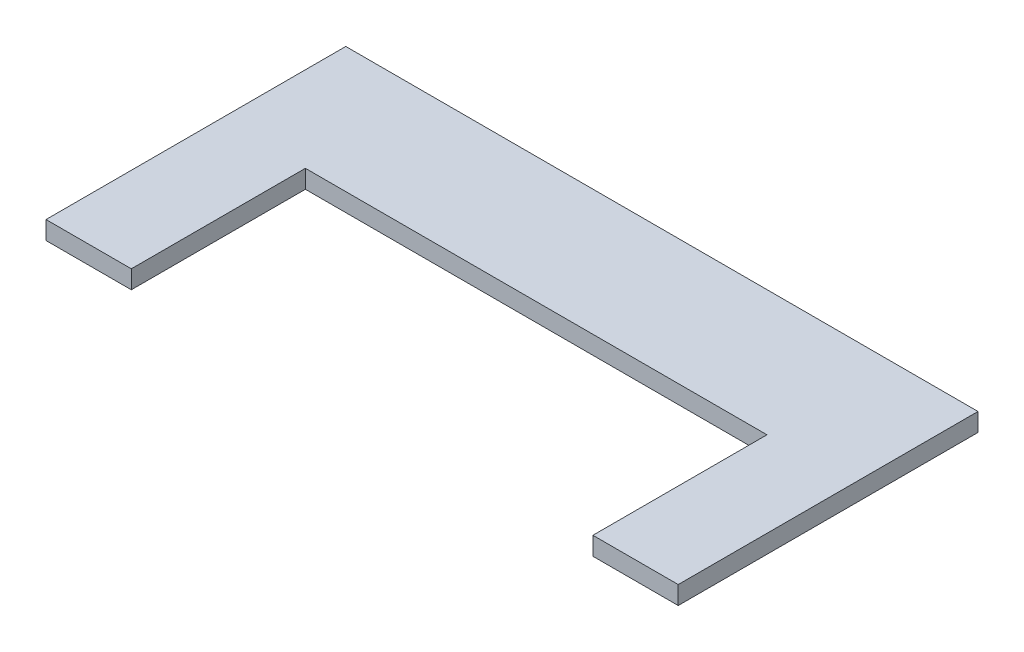
ISO-10303-21;
HEADER;
FILE_DESCRIPTION(('STEP AP214'),'2;1');
FILE_NAME('part.step','',(''),(''),'','','');
FILE_SCHEMA(('AUTOMOTIVE_DESIGN { 1 0 10303 214 1 1 1 1 }'));
ENDSEC;
DATA;
#1=APPLICATION_CONTEXT('core data for automotive mechanical design processes');
#2=APPLICATION_PROTOCOL_DEFINITION('international standard','automotive_design',2000,#1);
#3=PRODUCT_CONTEXT('',#1,'mechanical');
#4=PRODUCT('Part','Part','',(#3));
#5=PRODUCT_RELATED_PRODUCT_CATEGORY('part','',(#4));
#6=PRODUCT_DEFINITION_FORMATION('','',#4);
#7=PRODUCT_DEFINITION_CONTEXT('part definition',#1,'design');
#8=PRODUCT_DEFINITION('design','',#6,#7);
#9=PRODUCT_DEFINITION_SHAPE('','',#8);
#10=(LENGTH_UNIT() NAMED_UNIT(*) SI_UNIT(.MILLI.,.METRE.));
#11=(NAMED_UNIT(*) PLANE_ANGLE_UNIT() SI_UNIT($,.RADIAN.));
#12=(NAMED_UNIT(*) SI_UNIT($,.STERADIAN.) SOLID_ANGLE_UNIT());
#13=UNCERTAINTY_MEASURE_WITH_UNIT(LENGTH_MEASURE(1.E-05),#10,'distance_accuracy_value','');
#14=(GEOMETRIC_REPRESENTATION_CONTEXT(3) GLOBAL_UNCERTAINTY_ASSIGNED_CONTEXT((#13)) GLOBAL_UNIT_ASSIGNED_CONTEXT((#10,
#11,#12)) REPRESENTATION_CONTEXT('',''));
#15=CARTESIAN_POINT('',(0.,0.,0.));
#16=DIRECTION('',(0.,0.,1.));
#17=DIRECTION('',(1.,0.,0.));
#18=AXIS2_PLACEMENT_3D('',#15,#16,#17);
#19=CARTESIAN_POINT('',(-55.5722171016874,3.2,-52.7));
#20=DIRECTION('',(1.,0.,0.));
#21=DIRECTION('',(0.,0.,-1.));
#22=AXIS2_PLACEMENT_3D('',#19,#20,#21);
#23=PLANE('',#22);
#24=DIRECTION('',(0.,0.,1.));
#25=VECTOR('',#24,1.);
#26=CARTESIAN_POINT('',(-55.5722171016874,0.,-52.7));
#27=LINE('',#26,#25);
#28=CARTESIAN_POINT('',(-55.5722171016874,0.,-52.7));
#29=VERTEX_POINT('',#28);
#30=CARTESIAN_POINT('',(-55.5722171016874,0.,0.));
#31=VERTEX_POINT('',#30);
#32=EDGE_CURVE('E129',#29,#31,#27,.T.);
#33=ORIENTED_EDGE('',*,*,#32,.T.);
#34=DIRECTION('',(0.,-1.,0.));
#35=VECTOR('',#34,1.);
#36=CARTESIAN_POINT('',(-55.5722171016874,3.2,0.));
#37=LINE('',#36,#35);
#38=CARTESIAN_POINT('',(-55.5722171016874,3.2,0.));
#39=VERTEX_POINT('',#38);
#40=EDGE_CURVE('E11',#39,#31,#37,.T.);
#41=ORIENTED_EDGE('',*,*,#40,.F.);
#42=DIRECTION('',(0.,0.,1.));
#43=VECTOR('',#42,1.);
#44=CARTESIAN_POINT('',(-55.5722171016874,3.2,-52.7));
#45=LINE('',#44,#43);
#46=CARTESIAN_POINT('',(-55.5722171016874,3.2,-52.7));
#47=VERTEX_POINT('',#46);
#48=EDGE_CURVE('E143',#47,#39,#45,.T.);
#49=ORIENTED_EDGE('',*,*,#48,.F.);
#50=DIRECTION('',(0.,-1.,0.));
#51=VECTOR('',#50,1.);
#52=CARTESIAN_POINT('',(-55.5722171016874,3.2,-52.7));
#53=LINE('',#52,#51);
#54=EDGE_CURVE('E125',#47,#29,#53,.T.);
#55=ORIENTED_EDGE('',*,*,#54,.T.);
#56=EDGE_LOOP('',(#33,#41,#49,#55));
#57=FACE_BOUND('',#56,.T.);
#58=ADVANCED_FACE('F33',(#57),#23,.F.);
#59=CARTESIAN_POINT('',(-40.5722171016874,3.2,0.));
#60=DIRECTION('',(0.,0.,-1.));
#61=DIRECTION('',(-1.,0.,0.));
#62=AXIS2_PLACEMENT_3D('',#59,#60,#61);
#63=PLANE('',#62);
#64=DIRECTION('',(1.,0.,0.));
#65=VECTOR('',#64,1.);
#66=CARTESIAN_POINT('',(-40.5722171016874,0.,0.));
#67=LINE('',#66,#65);
#68=CARTESIAN_POINT('',(-40.5722171016874,0.,0.));
#69=VERTEX_POINT('',#68);
#70=EDGE_CURVE('E132',#31,#69,#67,.T.);
#71=ORIENTED_EDGE('',*,*,#70,.T.);
#72=DIRECTION('',(0.,-1.,0.));
#73=VECTOR('',#72,1.);
#74=CARTESIAN_POINT('',(-40.5722171016874,3.2,0.));
#75=LINE('',#74,#73);
#76=CARTESIAN_POINT('',(-40.5722171016874,3.2,0.));
#77=VERTEX_POINT('',#76);
#78=EDGE_CURVE('E41',#77,#69,#75,.T.);
#79=ORIENTED_EDGE('',*,*,#78,.F.);
#80=DIRECTION('',(1.,0.,0.));
#81=VECTOR('',#80,1.);
#82=CARTESIAN_POINT('',(-40.5722171016874,3.2,0.));
#83=LINE('',#82,#81);
#84=EDGE_CURVE('E92',#39,#77,#83,.T.);
#85=ORIENTED_EDGE('',*,*,#84,.F.);
#86=ORIENTED_EDGE('',*,*,#40,.T.);
#87=EDGE_LOOP('',(#71,#79,#85,#86));
#88=FACE_BOUND('',#87,.T.);
#89=ADVANCED_FACE('F178',(#88),#63,.F.);
#90=CARTESIAN_POINT('',(-40.5722171016874,3.2,-30.6));
#91=DIRECTION('',(-1.,0.,0.));
#92=DIRECTION('',(0.,0.,1.));
#93=AXIS2_PLACEMENT_3D('',#90,#91,#92);
#94=PLANE('',#93);
#95=DIRECTION('',(0.,0.,-1.));
#96=VECTOR('',#95,1.);
#97=CARTESIAN_POINT('',(-40.5722171016874,0.,-30.6));
#98=LINE('',#97,#96);
#99=CARTESIAN_POINT('',(-40.5722171016874,0.,-30.6));
#100=VERTEX_POINT('',#99);
#101=EDGE_CURVE('E134',#69,#100,#98,.T.);
#102=ORIENTED_EDGE('',*,*,#101,.T.);
#103=DIRECTION('',(0.,-1.,0.));
#104=VECTOR('',#103,1.);
#105=CARTESIAN_POINT('',(-40.5722171016874,3.2,-30.6));
#106=LINE('',#105,#104);
#107=CARTESIAN_POINT('',(-40.5722171016874,3.2,-30.6));
#108=VERTEX_POINT('',#107);
#109=EDGE_CURVE('E150',#108,#100,#106,.T.);
#110=ORIENTED_EDGE('',*,*,#109,.F.);
#111=DIRECTION('',(0.,0.,-1.));
#112=VECTOR('',#111,1.);
#113=CARTESIAN_POINT('',(-40.5722171016874,3.2,-30.6));
#114=LINE('',#113,#112);
#115=EDGE_CURVE('E158',#77,#108,#114,.T.);
#116=ORIENTED_EDGE('',*,*,#115,.F.);
#117=ORIENTED_EDGE('',*,*,#78,.T.);
#118=EDGE_LOOP('',(#102,#110,#116,#117));
#119=FACE_BOUND('',#118,.T.);
#120=ADVANCED_FACE('F156',(#119),#94,.F.);
#121=CARTESIAN_POINT('',(40.5722171016874,3.2,-30.6));
#122=DIRECTION('',(0.,0.,-1.));
#123=DIRECTION('',(-1.,0.,0.));
#124=AXIS2_PLACEMENT_3D('',#121,#122,#123);
#125=PLANE('',#124);
#126=DIRECTION('',(1.,0.,0.));
#127=VECTOR('',#126,1.);
#128=CARTESIAN_POINT('',(40.5722171016874,0.,-30.6));
#129=LINE('',#128,#127);
#130=CARTESIAN_POINT('',(40.5722171016874,0.,-30.6));
#131=VERTEX_POINT('',#130);
#132=EDGE_CURVE('E136',#100,#131,#129,.T.);
#133=ORIENTED_EDGE('',*,*,#132,.T.);
#134=DIRECTION('',(0.,-1.,0.));
#135=VECTOR('',#134,1.);
#136=CARTESIAN_POINT('',(40.5722171016874,3.2,-30.6));
#137=LINE('',#136,#135);
#138=CARTESIAN_POINT('',(40.5722171016874,3.2,-30.6));
#139=VERTEX_POINT('',#138);
#140=EDGE_CURVE('E147',#139,#131,#137,.T.);
#141=ORIENTED_EDGE('',*,*,#140,.F.);
#142=DIRECTION('',(1.,0.,0.));
#143=VECTOR('',#142,1.);
#144=CARTESIAN_POINT('',(40.5722171016874,3.2,-30.6));
#145=LINE('',#144,#143);
#146=EDGE_CURVE('E170',#108,#139,#145,.T.);
#147=ORIENTED_EDGE('',*,*,#146,.F.);
#148=ORIENTED_EDGE('',*,*,#109,.T.);
#149=EDGE_LOOP('',(#133,#141,#147,#148));
#150=FACE_BOUND('',#149,.T.);
#151=ADVANCED_FACE('F166',(#150),#125,.F.);
#152=CARTESIAN_POINT('',(40.5722171016874,3.2,0.));
#153=DIRECTION('',(1.,0.,0.));
#154=DIRECTION('',(0.,0.,-1.));
#155=AXIS2_PLACEMENT_3D('',#152,#153,#154);
#156=PLANE('',#155);
#157=DIRECTION('',(0.,0.,1.));
#158=VECTOR('',#157,1.);
#159=CARTESIAN_POINT('',(40.5722171016874,0.,0.));
#160=LINE('',#159,#158);
#161=CARTESIAN_POINT('',(40.5722171016874,0.,0.));
#162=VERTEX_POINT('',#161);
#163=EDGE_CURVE('E138',#131,#162,#160,.T.);
#164=ORIENTED_EDGE('',*,*,#163,.T.);
#165=DIRECTION('',(0.,-1.,0.));
#166=VECTOR('',#165,1.);
#167=CARTESIAN_POINT('',(40.5722171016874,3.2,0.));
#168=LINE('',#167,#166);
#169=CARTESIAN_POINT('',(40.5722171016874,3.2,0.));
#170=VERTEX_POINT('',#169);
#171=EDGE_CURVE('E120',#170,#162,#168,.T.);
#172=ORIENTED_EDGE('',*,*,#171,.F.);
#173=DIRECTION('',(0.,0.,1.));
#174=VECTOR('',#173,1.);
#175=CARTESIAN_POINT('',(40.5722171016874,3.2,0.));
#176=LINE('',#175,#174);
#177=EDGE_CURVE('E111',#139,#170,#176,.T.);
#178=ORIENTED_EDGE('',*,*,#177,.F.);
#179=ORIENTED_EDGE('',*,*,#140,.T.);
#180=EDGE_LOOP('',(#164,#172,#178,#179));
#181=FACE_BOUND('',#180,.T.);
#182=ADVANCED_FACE('F169',(#181),#156,.F.);
#183=CARTESIAN_POINT('',(55.5722171016874,3.2,0.));
#184=DIRECTION('',(0.,0.,-1.));
#185=DIRECTION('',(-1.,0.,0.));
#186=AXIS2_PLACEMENT_3D('',#183,#184,#185);
#187=PLANE('',#186);
#188=DIRECTION('',(1.,0.,0.));
#189=VECTOR('',#188,1.);
#190=CARTESIAN_POINT('',(55.5722171016874,0.,0.));
#191=LINE('',#190,#189);
#192=CARTESIAN_POINT('',(55.5722171016874,0.,0.));
#193=VERTEX_POINT('',#192);
#194=EDGE_CURVE('E119',#162,#193,#191,.T.);
#195=ORIENTED_EDGE('',*,*,#194,.T.);
#196=DIRECTION('',(0.,-1.,0.));
#197=VECTOR('',#196,1.);
#198=CARTESIAN_POINT('',(55.5722171016874,3.2,0.));
#199=LINE('',#198,#197);
#200=CARTESIAN_POINT('',(55.5722171016874,3.2,0.));
#201=VERTEX_POINT('',#200);
#202=EDGE_CURVE('E116',#201,#193,#199,.T.);
#203=ORIENTED_EDGE('',*,*,#202,.F.);
#204=DIRECTION('',(1.,0.,0.));
#205=VECTOR('',#204,1.);
#206=CARTESIAN_POINT('',(55.5722171016874,3.2,0.));
#207=LINE('',#206,#205);
#208=EDGE_CURVE('E105',#170,#201,#207,.T.);
#209=ORIENTED_EDGE('',*,*,#208,.F.);
#210=ORIENTED_EDGE('',*,*,#171,.T.);
#211=EDGE_LOOP('',(#195,#203,#209,#210));
#212=FACE_BOUND('',#211,.T.);
#213=ADVANCED_FACE('F117',(#212),#187,.F.);
#214=CARTESIAN_POINT('',(55.5722171016874,3.2,-52.7));
#215=DIRECTION('',(-1.,0.,0.));
#216=DIRECTION('',(0.,0.,1.));
#217=AXIS2_PLACEMENT_3D('',#214,#215,#216);
#218=PLANE('',#217);
#219=DIRECTION('',(0.,0.,-1.));
#220=VECTOR('',#219,1.);
#221=CARTESIAN_POINT('',(55.5722171016874,0.,-52.7));
#222=LINE('',#221,#220);
#223=CARTESIAN_POINT('',(55.5722171016874,0.,-52.7));
#224=VERTEX_POINT('',#223);
#225=EDGE_CURVE('E78',#193,#224,#222,.T.);
#226=ORIENTED_EDGE('',*,*,#225,.T.);
#227=DIRECTION('',(0.,-1.,0.));
#228=VECTOR('',#227,1.);
#229=CARTESIAN_POINT('',(55.5722171016874,3.2,-52.7));
#230=LINE('',#229,#228);
#231=CARTESIAN_POINT('',(55.5722171016874,3.2,-52.7));
#232=VERTEX_POINT('',#231);
#233=EDGE_CURVE('E121',#232,#224,#230,.T.);
#234=ORIENTED_EDGE('',*,*,#233,.F.);
#235=DIRECTION('',(0.,0.,-1.));
#236=VECTOR('',#235,1.);
#237=CARTESIAN_POINT('',(55.5722171016874,3.2,-52.7));
#238=LINE('',#237,#236);
#239=EDGE_CURVE('E109',#201,#232,#238,.T.);
#240=ORIENTED_EDGE('',*,*,#239,.F.);
#241=ORIENTED_EDGE('',*,*,#202,.T.);
#242=EDGE_LOOP('',(#226,#234,#240,#241));
#243=FACE_BOUND('',#242,.T.);
#244=ADVANCED_FACE('F123',(#243),#218,.F.);
#245=CARTESIAN_POINT('',(-55.5722171016874,3.2,-52.7));
#246=DIRECTION('',(0.,0.,1.));
#247=DIRECTION('',(1.,0.,0.));
#248=AXIS2_PLACEMENT_3D('',#245,#246,#247);
#249=PLANE('',#248);
#250=DIRECTION('',(-1.,0.,0.));
#251=VECTOR('',#250,1.);
#252=CARTESIAN_POINT('',(-55.5722171016874,0.,-52.7));
#253=LINE('',#252,#251);
#254=EDGE_CURVE('E84',#224,#29,#253,.T.);
#255=ORIENTED_EDGE('',*,*,#254,.T.);
#256=ORIENTED_EDGE('',*,*,#54,.F.);
#257=DIRECTION('',(-1.,0.,0.));
#258=VECTOR('',#257,1.);
#259=CARTESIAN_POINT('',(-55.5722171016874,3.2,-52.7));
#260=LINE('',#259,#258);
#261=EDGE_CURVE('E49',#232,#47,#260,.T.);
#262=ORIENTED_EDGE('',*,*,#261,.F.);
#263=ORIENTED_EDGE('',*,*,#233,.T.);
#264=EDGE_LOOP('',(#255,#256,#262,#263));
#265=FACE_BOUND('',#264,.T.);
#266=ADVANCED_FACE('F194',(#265),#249,.F.);
#267=CARTESIAN_POINT('',(0.,3.2,0.));
#268=DIRECTION('',(0.,-1.,0.));
#269=DIRECTION('',(0.,0.,-1.));
#270=AXIS2_PLACEMENT_3D('',#267,#268,#269);
#271=PLANE('',#270);
#272=ORIENTED_EDGE('',*,*,#48,.T.);
#273=ORIENTED_EDGE('',*,*,#84,.T.);
#274=ORIENTED_EDGE('',*,*,#115,.T.);
#275=ORIENTED_EDGE('',*,*,#146,.T.);
#276=ORIENTED_EDGE('',*,*,#177,.T.);
#277=ORIENTED_EDGE('',*,*,#208,.T.);
#278=ORIENTED_EDGE('',*,*,#239,.T.);
#279=ORIENTED_EDGE('',*,*,#261,.T.);
#280=EDGE_LOOP('',(#272,#273,#274,#275,#276,#277,#278,#279));
#281=FACE_BOUND('',#280,.T.);
#282=ADVANCED_FACE('F107',(#281),#271,.F.);
#283=CARTESIAN_POINT('',(0.,0.,0.));
#284=DIRECTION('',(0.,-1.,0.));
#285=DIRECTION('',(0.,0.,-1.));
#286=AXIS2_PLACEMENT_3D('',#283,#284,#285);
#287=PLANE('',#286);
#288=ORIENTED_EDGE('',*,*,#32,.F.);
#289=ORIENTED_EDGE('',*,*,#254,.F.);
#290=ORIENTED_EDGE('',*,*,#225,.F.);
#291=ORIENTED_EDGE('',*,*,#194,.F.);
#292=ORIENTED_EDGE('',*,*,#163,.F.);
#293=ORIENTED_EDGE('',*,*,#132,.F.);
#294=ORIENTED_EDGE('',*,*,#101,.F.);
#295=ORIENTED_EDGE('',*,*,#70,.F.);
#296=EDGE_LOOP('',(#288,#289,#290,#291,#292,#293,#294,#295));
#297=FACE_BOUND('',#296,.T.);
#298=ADVANCED_FACE('F162',(#297),#287,.T.);
#299=CLOSED_SHELL('',(#58,#89,#120,#151,#182,#213,#244,#266,#282,#298));
#300=MANIFOLD_SOLID_BREP('B2',#299);
#301=ADVANCED_BREP_SHAPE_REPRESENTATION('',(#18,#300),#14);
#302=SHAPE_DEFINITION_REPRESENTATION(#9,#301);
ENDSEC;
END-ISO-10303-21;
